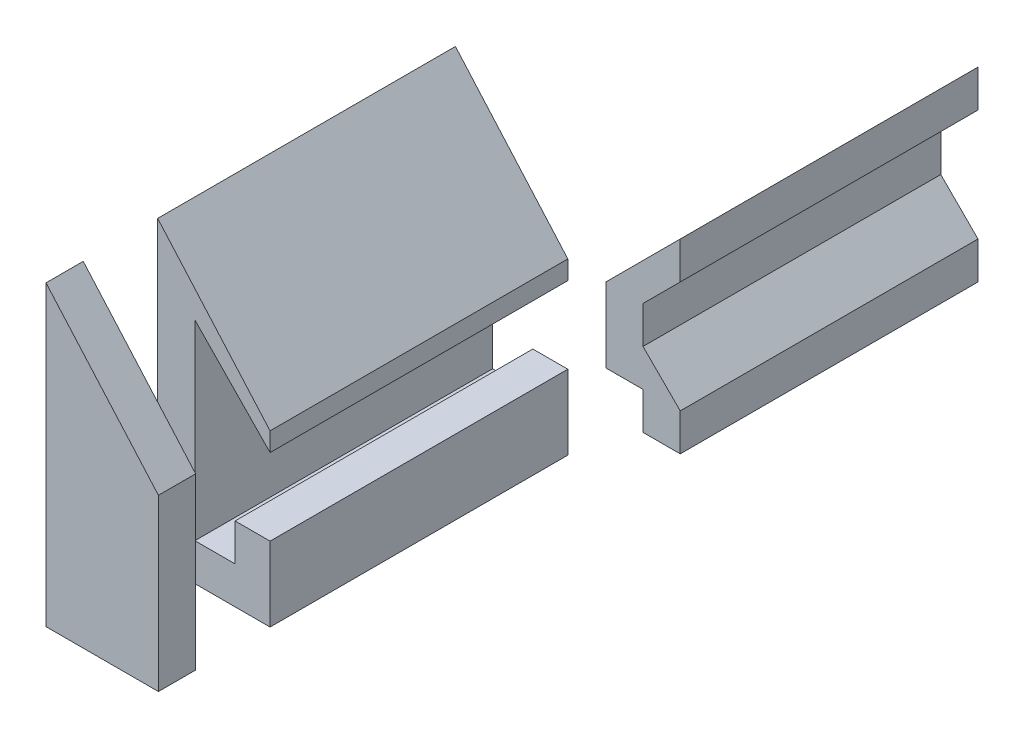
ISO-10303-21;
HEADER;
FILE_DESCRIPTION(('STEP AP214'),'2;1');
FILE_NAME('part.step','',(''),(''),'','','');
FILE_SCHEMA(('AUTOMOTIVE_DESIGN { 1 0 10303 214 1 1 1 1 }'));
ENDSEC;
DATA;
#1=APPLICATION_CONTEXT('core data for automotive mechanical design processes');
#2=APPLICATION_PROTOCOL_DEFINITION('international standard','automotive_design',2000,#1);
#3=PRODUCT_CONTEXT('',#1,'mechanical');
#4=PRODUCT('Part','Part','',(#3));
#5=PRODUCT_RELATED_PRODUCT_CATEGORY('part','',(#4));
#6=PRODUCT_DEFINITION_FORMATION('','',#4);
#7=PRODUCT_DEFINITION_CONTEXT('part definition',#1,'design');
#8=PRODUCT_DEFINITION('design','',#6,#7);
#9=PRODUCT_DEFINITION_SHAPE('','',#8);
#10=(LENGTH_UNIT() NAMED_UNIT(*) SI_UNIT(.MILLI.,.METRE.));
#11=(NAMED_UNIT(*) PLANE_ANGLE_UNIT() SI_UNIT($,.RADIAN.));
#12=(NAMED_UNIT(*) SI_UNIT($,.STERADIAN.) SOLID_ANGLE_UNIT());
#13=UNCERTAINTY_MEASURE_WITH_UNIT(LENGTH_MEASURE(1.E-05),#10,'distance_accuracy_value','');
#14=(GEOMETRIC_REPRESENTATION_CONTEXT(3) GLOBAL_UNCERTAINTY_ASSIGNED_CONTEXT((#13)) GLOBAL_UNIT_ASSIGNED_CONTEXT((#10,
#11,#12)) REPRESENTATION_CONTEXT('',''));
#15=CARTESIAN_POINT('',(0.,0.,0.));
#16=DIRECTION('',(0.,0.,1.));
#17=DIRECTION('',(1.,0.,0.));
#18=AXIS2_PLACEMENT_3D('',#15,#16,#17);
#19=CARTESIAN_POINT('',(0.,-2.5,-50.));
#20=DIRECTION('',(-0.707106781186547,-0.707106781186548,0.));
#21=DIRECTION('',(0.707106781186548,-0.707106781186547,0.));
#22=AXIS2_PLACEMENT_3D('',#19,#20,#21);
#23=PLANE('',#22);
#24=DIRECTION('',(0.707106781186548,-0.707106781186547,0.));
#25=VECTOR('',#24,1.);
#26=CARTESIAN_POINT('',(0.,-2.5,-10.));
#27=LINE('',#26,#25);
#28=CARTESIAN_POINT('',(0.,-2.5,-10.));
#29=VERTEX_POINT('',#28);
#30=CARTESIAN_POINT('',(5.,-7.49999999999999,-10.));
#31=VERTEX_POINT('',#30);
#32=EDGE_CURVE('E155',#29,#31,#27,.T.);
#33=ORIENTED_EDGE('',*,*,#32,.T.);
#34=DIRECTION('',(0.,0.,1.));
#35=VECTOR('',#34,1.);
#36=CARTESIAN_POINT('',(5.,-7.49999999999999,-50.));
#37=LINE('',#36,#35);
#38=CARTESIAN_POINT('',(5.,-7.49999999999999,-50.));
#39=VERTEX_POINT('',#38);
#40=EDGE_CURVE('E12',#39,#31,#37,.T.);
#41=ORIENTED_EDGE('',*,*,#40,.F.);
#42=DIRECTION('',(0.707106781186548,-0.707106781186547,0.));
#43=VECTOR('',#42,1.);
#44=CARTESIAN_POINT('',(0.,-2.5,-50.));
#45=LINE('',#44,#43);
#46=CARTESIAN_POINT('',(0.,-2.5,-50.));
#47=VERTEX_POINT('',#46);
#48=EDGE_CURVE('E175',#47,#39,#45,.T.);
#49=ORIENTED_EDGE('',*,*,#48,.F.);
#50=DIRECTION('',(0.,0.,1.));
#51=VECTOR('',#50,1.);
#52=CARTESIAN_POINT('',(0.,-2.5,-50.));
#53=LINE('',#52,#51);
#54=EDGE_CURVE('E151',#47,#29,#53,.T.);
#55=ORIENTED_EDGE('',*,*,#54,.T.);
#56=EDGE_LOOP('',(#33,#41,#49,#55));
#57=FACE_BOUND('',#56,.T.);
#58=ADVANCED_FACE('F46',(#57),#23,.F.);
#59=CARTESIAN_POINT('',(5.,-7.49999999999999,-50.));
#60=DIRECTION('',(-1.,0.,0.));
#61=DIRECTION('',(0.,-1.,0.));
#62=AXIS2_PLACEMENT_3D('',#59,#60,#61);
#63=PLANE('',#62);
#64=DIRECTION('',(0.,-1.,0.));
#65=VECTOR('',#64,1.);
#66=CARTESIAN_POINT('',(5.,-7.49999999999999,-10.));
#67=LINE('',#66,#65);
#68=CARTESIAN_POINT('',(5.,-12.5,-10.));
#69=VERTEX_POINT('',#68);
#70=EDGE_CURVE('E158',#31,#69,#67,.T.);
#71=ORIENTED_EDGE('',*,*,#70,.T.);
#72=DIRECTION('',(0.,0.,1.));
#73=VECTOR('',#72,1.);
#74=CARTESIAN_POINT('',(5.,-12.5,-50.));
#75=LINE('',#74,#73);
#76=CARTESIAN_POINT('',(5.,-12.5,-50.));
#77=VERTEX_POINT('',#76);
#78=EDGE_CURVE('E54',#77,#69,#75,.T.);
#79=ORIENTED_EDGE('',*,*,#78,.F.);
#80=DIRECTION('',(0.,-1.,0.));
#81=VECTOR('',#80,1.);
#82=CARTESIAN_POINT('',(5.,-7.49999999999999,-50.));
#83=LINE('',#82,#81);
#84=EDGE_CURVE('E111',#39,#77,#83,.T.);
#85=ORIENTED_EDGE('',*,*,#84,.F.);
#86=ORIENTED_EDGE('',*,*,#40,.T.);
#87=EDGE_LOOP('',(#71,#79,#85,#86));
#88=FACE_BOUND('',#87,.T.);
#89=ADVANCED_FACE('F221',(#88),#63,.F.);
#90=CARTESIAN_POINT('',(5.,-12.5,-50.));
#91=DIRECTION('',(0.,1.,0.));
#92=DIRECTION('',(0.,0.,1.));
#93=AXIS2_PLACEMENT_3D('',#90,#91,#92);
#94=PLANE('',#93);
#95=DIRECTION('',(-1.,0.,0.));
#96=VECTOR('',#95,1.);
#97=CARTESIAN_POINT('',(5.,-12.5,-10.));
#98=LINE('',#97,#96);
#99=CARTESIAN_POINT('',(0.,-12.5,-10.));
#100=VERTEX_POINT('',#99);
#101=EDGE_CURVE('E160',#69,#100,#98,.T.);
#102=ORIENTED_EDGE('',*,*,#101,.T.);
#103=DIRECTION('',(0.,0.,1.));
#104=VECTOR('',#103,1.);
#105=CARTESIAN_POINT('',(0.,-12.5,-50.));
#106=LINE('',#105,#104);
#107=CARTESIAN_POINT('',(0.,-12.5,-50.));
#108=VERTEX_POINT('',#107);
#109=EDGE_CURVE('E186',#108,#100,#106,.T.);
#110=ORIENTED_EDGE('',*,*,#109,.F.);
#111=DIRECTION('',(-1.,0.,0.));
#112=VECTOR('',#111,1.);
#113=CARTESIAN_POINT('',(5.,-12.5,-50.));
#114=LINE('',#113,#112);
#115=EDGE_CURVE('E194',#77,#108,#114,.T.);
#116=ORIENTED_EDGE('',*,*,#115,.F.);
#117=ORIENTED_EDGE('',*,*,#78,.T.);
#118=EDGE_LOOP('',(#102,#110,#116,#117));
#119=FACE_BOUND('',#118,.T.);
#120=ADVANCED_FACE('F192',(#119),#94,.F.);
#121=CARTESIAN_POINT('',(0.,-12.5,-50.));
#122=DIRECTION('',(1.,0.,0.));
#123=DIRECTION('',(0.,0.,-1.));
#124=AXIS2_PLACEMENT_3D('',#121,#122,#123);
#125=PLANE('',#124);
#126=DIRECTION('',(0.,1.,0.));
#127=VECTOR('',#126,1.);
#128=CARTESIAN_POINT('',(0.,-12.5,-10.));
#129=LINE('',#128,#127);
#130=CARTESIAN_POINT('',(0.,-7.5,-10.));
#131=VERTEX_POINT('',#130);
#132=EDGE_CURVE('E162',#100,#131,#129,.T.);
#133=ORIENTED_EDGE('',*,*,#132,.T.);
#134=DIRECTION('',(0.,0.,1.));
#135=VECTOR('',#134,1.);
#136=CARTESIAN_POINT('',(0.,-7.5,-50.));
#137=LINE('',#136,#135);
#138=CARTESIAN_POINT('',(0.,-7.5,-50.));
#139=VERTEX_POINT('',#138);
#140=EDGE_CURVE('E183',#139,#131,#137,.T.);
#141=ORIENTED_EDGE('',*,*,#140,.F.);
#142=DIRECTION('',(0.,1.,0.));
#143=VECTOR('',#142,1.);
#144=CARTESIAN_POINT('',(0.,-12.5,-50.));
#145=LINE('',#144,#143);
#146=EDGE_CURVE('E211',#108,#139,#145,.T.);
#147=ORIENTED_EDGE('',*,*,#146,.F.);
#148=ORIENTED_EDGE('',*,*,#109,.T.);
#149=EDGE_LOOP('',(#133,#141,#147,#148));
#150=FACE_BOUND('',#149,.T.);
#151=ADVANCED_FACE('F202',(#150),#125,.F.);
#152=CARTESIAN_POINT('',(0.,-7.5,-50.));
#153=DIRECTION('',(0.,1.,0.));
#154=DIRECTION('',(0.,0.,1.));
#155=AXIS2_PLACEMENT_3D('',#152,#153,#154);
#156=PLANE('',#155);
#157=DIRECTION('',(-1.,0.,0.));
#158=VECTOR('',#157,1.);
#159=CARTESIAN_POINT('',(0.,-7.5,-10.));
#160=LINE('',#159,#158);
#161=CARTESIAN_POINT('',(-5.,-7.5,-10.));
#162=VERTEX_POINT('',#161);
#163=EDGE_CURVE('E164',#131,#162,#160,.T.);
#164=ORIENTED_EDGE('',*,*,#163,.T.);
#165=DIRECTION('',(0.,0.,1.));
#166=VECTOR('',#165,1.);
#167=CARTESIAN_POINT('',(-5.,-7.5,-50.));
#168=LINE('',#167,#166);
#169=CARTESIAN_POINT('',(-5.,-7.5,-50.));
#170=VERTEX_POINT('',#169);
#171=EDGE_CURVE('E181',#170,#162,#168,.T.);
#172=ORIENTED_EDGE('',*,*,#171,.F.);
#173=DIRECTION('',(-1.,0.,0.));
#174=VECTOR('',#173,1.);
#175=CARTESIAN_POINT('',(0.,-7.5,-50.));
#176=LINE('',#175,#174);
#177=EDGE_CURVE('E208',#139,#170,#176,.T.);
#178=ORIENTED_EDGE('',*,*,#177,.F.);
#179=ORIENTED_EDGE('',*,*,#140,.T.);
#180=EDGE_LOOP('',(#164,#172,#178,#179));
#181=FACE_BOUND('',#180,.T.);
#182=ADVANCED_FACE('F206',(#181),#156,.F.);
#183=CARTESIAN_POINT('',(-5.,2.5,-50.));
#184=DIRECTION('',(-1.,0.,0.));
#185=DIRECTION('',(0.,0.,1.));
#186=AXIS2_PLACEMENT_3D('',#183,#184,#185);
#187=PLANE('',#186);
#188=DIRECTION('',(0.,-1.,0.));
#189=VECTOR('',#188,1.);
#190=CARTESIAN_POINT('',(-5.,2.5,-10.));
#191=LINE('',#190,#189);
#192=CARTESIAN_POINT('',(-5.,2.5,-10.));
#193=VERTEX_POINT('',#192);
#194=EDGE_CURVE('E167',#193,#162,#191,.T.);
#195=ORIENTED_EDGE('',*,*,#194,.F.);
#196=DIRECTION('',(0.,0.,1.));
#197=VECTOR('',#196,1.);
#198=CARTESIAN_POINT('',(-5.,2.5,-50.));
#199=LINE('',#198,#197);
#200=CARTESIAN_POINT('',(-5.,2.5,-50.));
#201=VERTEX_POINT('',#200);
#202=EDGE_CURVE('E179',#201,#193,#199,.T.);
#203=ORIENTED_EDGE('',*,*,#202,.F.);
#204=DIRECTION('',(0.,-1.,0.));
#205=VECTOR('',#204,1.);
#206=CARTESIAN_POINT('',(-5.,2.5,-50.));
#207=LINE('',#206,#205);
#208=EDGE_CURVE('E210',#201,#170,#207,.T.);
#209=ORIENTED_EDGE('',*,*,#208,.T.);
#210=ORIENTED_EDGE('',*,*,#171,.T.);
#211=EDGE_LOOP('',(#195,#203,#209,#210));
#212=FACE_BOUND('',#211,.T.);
#213=ADVANCED_FACE('F233',(#212),#187,.T.);
#214=CARTESIAN_POINT('',(-5.,2.5,-50.));
#215=DIRECTION('',(0.707106781186547,-0.707106781186548,0.));
#216=DIRECTION('',(0.707106781186548,0.707106781186547,0.));
#217=AXIS2_PLACEMENT_3D('',#214,#215,#216);
#218=PLANE('',#217);
#219=DIRECTION('',(0.707106781186548,0.707106781186547,0.));
#220=VECTOR('',#219,1.);
#221=CARTESIAN_POINT('',(-5.,2.5,-10.));
#222=LINE('',#221,#220);
#223=CARTESIAN_POINT('',(5.,12.5,-10.));
#224=VERTEX_POINT('',#223);
#225=EDGE_CURVE('E170',#193,#224,#222,.T.);
#226=ORIENTED_EDGE('',*,*,#225,.T.);
#227=DIRECTION('',(0.,0.,1.));
#228=VECTOR('',#227,1.);
#229=CARTESIAN_POINT('',(5.,12.5,-50.));
#230=LINE('',#229,#228);
#231=CARTESIAN_POINT('',(5.,12.5,-50.));
#232=VERTEX_POINT('',#231);
#233=EDGE_CURVE('E146',#232,#224,#230,.T.);
#234=ORIENTED_EDGE('',*,*,#233,.F.);
#235=DIRECTION('',(0.707106781186548,0.707106781186547,0.));
#236=VECTOR('',#235,1.);
#237=CARTESIAN_POINT('',(-5.,2.5,-50.));
#238=LINE('',#237,#236);
#239=EDGE_CURVE('E137',#201,#232,#238,.T.);
#240=ORIENTED_EDGE('',*,*,#239,.F.);
#241=ORIENTED_EDGE('',*,*,#202,.T.);
#242=EDGE_LOOP('',(#226,#234,#240,#241));
#243=FACE_BOUND('',#242,.T.);
#244=ADVANCED_FACE('F236',(#243),#218,.F.);
#245=CARTESIAN_POINT('',(5.,12.5,-50.));
#246=DIRECTION('',(-1.,0.,0.));
#247=DIRECTION('',(0.,0.,1.));
#248=AXIS2_PLACEMENT_3D('',#245,#246,#247);
#249=PLANE('',#248);
#250=DIRECTION('',(0.,-1.,0.));
#251=VECTOR('',#250,1.);
#252=CARTESIAN_POINT('',(5.,12.5,-10.));
#253=LINE('',#252,#251);
#254=CARTESIAN_POINT('',(5.,7.5,-10.));
#255=VERTEX_POINT('',#254);
#256=EDGE_CURVE('E145',#224,#255,#253,.T.);
#257=ORIENTED_EDGE('',*,*,#256,.T.);
#258=DIRECTION('',(0.,0.,1.));
#259=VECTOR('',#258,1.);
#260=CARTESIAN_POINT('',(5.,7.5,-50.));
#261=LINE('',#260,#259);
#262=CARTESIAN_POINT('',(5.,7.5,-50.));
#263=VERTEX_POINT('',#262);
#264=EDGE_CURVE('E142',#263,#255,#261,.T.);
#265=ORIENTED_EDGE('',*,*,#264,.F.);
#266=DIRECTION('',(0.,-1.,0.));
#267=VECTOR('',#266,1.);
#268=CARTESIAN_POINT('',(5.,12.5,-50.));
#269=LINE('',#268,#267);
#270=EDGE_CURVE('E130',#232,#263,#269,.T.);
#271=ORIENTED_EDGE('',*,*,#270,.F.);
#272=ORIENTED_EDGE('',*,*,#233,.T.);
#273=EDGE_LOOP('',(#257,#265,#271,#272));
#274=FACE_BOUND('',#273,.T.);
#275=ADVANCED_FACE('F143',(#274),#249,.F.);
#276=CARTESIAN_POINT('',(5.,7.5,-50.));
#277=DIRECTION('',(-0.707106781186547,0.707106781186548,0.));
#278=DIRECTION('',(-0.707106781186548,-0.707106781186547,0.));
#279=AXIS2_PLACEMENT_3D('',#276,#277,#278);
#280=PLANE('',#279);
#281=DIRECTION('',(-0.707106781186548,-0.707106781186547,0.));
#282=VECTOR('',#281,1.);
#283=CARTESIAN_POINT('',(5.,7.5,-10.));
#284=LINE('',#283,#282);
#285=CARTESIAN_POINT('',(0.,2.5,-10.));
#286=VERTEX_POINT('',#285);
#287=EDGE_CURVE('E97',#255,#286,#284,.T.);
#288=ORIENTED_EDGE('',*,*,#287,.T.);
#289=DIRECTION('',(0.,0.,1.));
#290=VECTOR('',#289,1.);
#291=CARTESIAN_POINT('',(0.,2.5,-50.));
#292=LINE('',#291,#290);
#293=CARTESIAN_POINT('',(0.,2.5,-50.));
#294=VERTEX_POINT('',#293);
#295=EDGE_CURVE('E147',#294,#286,#292,.T.);
#296=ORIENTED_EDGE('',*,*,#295,.F.);
#297=DIRECTION('',(-0.707106781186548,-0.707106781186547,0.));
#298=VECTOR('',#297,1.);
#299=CARTESIAN_POINT('',(5.,7.5,-50.));
#300=LINE('',#299,#298);
#301=EDGE_CURVE('E134',#263,#294,#300,.T.);
#302=ORIENTED_EDGE('',*,*,#301,.F.);
#303=ORIENTED_EDGE('',*,*,#264,.T.);
#304=EDGE_LOOP('',(#288,#296,#302,#303));
#305=FACE_BOUND('',#304,.T.);
#306=ADVANCED_FACE('F149',(#305),#280,.F.);
#307=CARTESIAN_POINT('',(0.,2.5,-50.));
#308=DIRECTION('',(-1.,0.,0.));
#309=DIRECTION('',(0.,0.,1.));
#310=AXIS2_PLACEMENT_3D('',#307,#308,#309);
#311=PLANE('',#310);
#312=DIRECTION('',(0.,-1.,0.));
#313=VECTOR('',#312,1.);
#314=CARTESIAN_POINT('',(0.,2.5,-10.));
#315=LINE('',#314,#313);
#316=EDGE_CURVE('E103',#286,#29,#315,.T.);
#317=ORIENTED_EDGE('',*,*,#316,.T.);
#318=ORIENTED_EDGE('',*,*,#54,.F.);
#319=DIRECTION('',(0.,-1.,0.));
#320=VECTOR('',#319,1.);
#321=CARTESIAN_POINT('',(0.,2.5,-50.));
#322=LINE('',#321,#320);
#323=EDGE_CURVE('E62',#294,#47,#322,.T.);
#324=ORIENTED_EDGE('',*,*,#323,.F.);
#325=ORIENTED_EDGE('',*,*,#295,.T.);
#326=EDGE_LOOP('',(#317,#318,#324,#325));
#327=FACE_BOUND('',#326,.T.);
#328=ADVANCED_FACE('F245',(#327),#311,.F.);
#329=CARTESIAN_POINT('',(0.,0.,-50.));
#330=DIRECTION('',(0.,0.,1.));
#331=DIRECTION('',(1.,0.,0.));
#332=AXIS2_PLACEMENT_3D('',#329,#330,#331);
#333=PLANE('',#332);
#334=ORIENTED_EDGE('',*,*,#48,.T.);
#335=ORIENTED_EDGE('',*,*,#84,.T.);
#336=ORIENTED_EDGE('',*,*,#115,.T.);
#337=ORIENTED_EDGE('',*,*,#146,.T.);
#338=ORIENTED_EDGE('',*,*,#177,.T.);
#339=ORIENTED_EDGE('',*,*,#208,.F.);
#340=ORIENTED_EDGE('',*,*,#239,.T.);
#341=ORIENTED_EDGE('',*,*,#270,.T.);
#342=ORIENTED_EDGE('',*,*,#301,.T.);
#343=ORIENTED_EDGE('',*,*,#323,.T.);
#344=EDGE_LOOP('',(#334,#335,#336,#337,#338,#339,#340,#341,#342,#343));
#345=FACE_BOUND('',#344,.T.);
#346=ADVANCED_FACE('F132',(#345),#333,.F.);
#347=CARTESIAN_POINT('',(0.,0.,-10.));
#348=DIRECTION('',(0.,0.,1.));
#349=DIRECTION('',(1.,0.,0.));
#350=AXIS2_PLACEMENT_3D('',#347,#348,#349);
#351=PLANE('',#350);
#352=ORIENTED_EDGE('',*,*,#32,.F.);
#353=ORIENTED_EDGE('',*,*,#316,.F.);
#354=ORIENTED_EDGE('',*,*,#287,.F.);
#355=ORIENTED_EDGE('',*,*,#256,.F.);
#356=ORIENTED_EDGE('',*,*,#225,.F.);
#357=ORIENTED_EDGE('',*,*,#194,.T.);
#358=ORIENTED_EDGE('',*,*,#163,.F.);
#359=ORIENTED_EDGE('',*,*,#132,.F.);
#360=ORIENTED_EDGE('',*,*,#101,.F.);
#361=ORIENTED_EDGE('',*,*,#70,.F.);
#362=EDGE_LOOP('',(#352,#353,#354,#355,#356,#357,#358,#359,#360,#361));
#363=FACE_BOUND('',#362,.T.);
#364=ADVANCED_FACE('F198',(#363),#351,.T.);
#365=CLOSED_SHELL('',(#58,#89,#120,#151,#182,#213,#244,#275,#306,#328,#346,#364));
#366=MANIFOLD_SOLID_BREP('B2',#365);
#367=CARTESIAN_POINT('',(-0.1,12.6319336218707,55.));
#368=DIRECTION('',(-0.7508848175328,-0.660433184204681,0.));
#369=DIRECTION('',(0.660433184204681,-0.7508848175328,0.));
#370=AXIS2_PLACEMENT_3D('',#367,#368,#369);
#371=PLANE('',#370);
#372=DIRECTION('',(-0.660433184204681,0.7508848175328,0.));
#373=VECTOR('',#372,1.);
#374=CARTESIAN_POINT('',(-0.1,12.6319336218707,50.));
#375=LINE('',#374,#373);
#376=CARTESIAN_POINT('',(-0.1,12.6319336218707,50.));
#377=VERTEX_POINT('',#376);
#378=CARTESIAN_POINT('',(-15.2,29.8,50.));
#379=VERTEX_POINT('',#378);
#380=EDGE_CURVE('E389',#377,#379,#375,.T.);
#381=ORIENTED_EDGE('',*,*,#380,.T.);
#382=DIRECTION('',(0.,0.,-1.));
#383=VECTOR('',#382,1.);
#384=CARTESIAN_POINT('',(-15.2,29.8,55.));
#385=LINE('',#384,#383);
#386=CARTESIAN_POINT('',(-15.2,29.8,55.));
#387=VERTEX_POINT('',#386);
#388=EDGE_CURVE('E343',#387,#379,#385,.T.);
#389=ORIENTED_EDGE('',*,*,#388,.F.);
#390=DIRECTION('',(-0.660433184204681,0.7508848175328,0.));
#391=VECTOR('',#390,1.);
#392=CARTESIAN_POINT('',(-0.1,12.6319336218707,55.));
#393=LINE('',#392,#391);
#394=CARTESIAN_POINT('',(-0.1,12.6319336218707,55.));
#395=VERTEX_POINT('',#394);
#396=EDGE_CURVE('E383',#395,#387,#393,.T.);
#397=ORIENTED_EDGE('',*,*,#396,.F.);
#398=DIRECTION('',(0.,0.,-1.));
#399=VECTOR('',#398,1.);
#400=CARTESIAN_POINT('',(-0.1,12.6319336218707,55.));
#401=LINE('',#400,#399);
#402=EDGE_CURVE('E44',#395,#377,#401,.T.);
#403=ORIENTED_EDGE('',*,*,#402,.T.);
#404=EDGE_LOOP('',(#381,#389,#397,#403));
#405=FACE_BOUND('',#404,.T.);
#406=ADVANCED_FACE('F335',(#405),#371,.F.);
#407=CARTESIAN_POINT('',(-15.2,29.8,55.));
#408=DIRECTION('',(1.,0.,0.));
#409=DIRECTION('',(0.,1.,0.));
#410=AXIS2_PLACEMENT_3D('',#407,#408,#409);
#411=PLANE('',#410);
#412=DIRECTION('',(0.,-1.,0.));
#413=VECTOR('',#412,1.);
#414=CARTESIAN_POINT('',(-15.2,29.8,50.));
#415=LINE('',#414,#413);
#416=CARTESIAN_POINT('',(-15.2,-10.2,50.));
#417=VERTEX_POINT('',#416);
#418=EDGE_CURVE('E369',#379,#417,#415,.T.);
#419=ORIENTED_EDGE('',*,*,#418,.T.);
#420=DIRECTION('',(0.,0.,-1.));
#421=VECTOR('',#420,1.);
#422=CARTESIAN_POINT('',(-15.2,-10.2,55.));
#423=LINE('',#422,#421);
#424=CARTESIAN_POINT('',(-15.2,-10.2,55.));
#425=VERTEX_POINT('',#424);
#426=EDGE_CURVE('E390',#425,#417,#423,.T.);
#427=ORIENTED_EDGE('',*,*,#426,.F.);
#428=DIRECTION('',(0.,-1.,0.));
#429=VECTOR('',#428,1.);
#430=CARTESIAN_POINT('',(-15.2,29.8,55.));
#431=LINE('',#430,#429);
#432=EDGE_CURVE('E387',#387,#425,#431,.T.);
#433=ORIENTED_EDGE('',*,*,#432,.F.);
#434=ORIENTED_EDGE('',*,*,#388,.T.);
#435=EDGE_LOOP('',(#419,#427,#433,#434));
#436=FACE_BOUND('',#435,.T.);
#437=ADVANCED_FACE('F391',(#436),#411,.F.);
#438=CARTESIAN_POINT('',(-15.2,-10.2,55.));
#439=DIRECTION('',(0.,1.,0.));
#440=DIRECTION('',(-1.,0.,0.));
#441=AXIS2_PLACEMENT_3D('',#438,#439,#440);
#442=PLANE('',#441);
#443=DIRECTION('',(1.,0.,0.));
#444=VECTOR('',#443,1.);
#445=CARTESIAN_POINT('',(-15.2,-10.2,50.));
#446=LINE('',#445,#444);
#447=CARTESIAN_POINT('',(-0.0999999999999988,-10.2,50.));
#448=VERTEX_POINT('',#447);
#449=EDGE_CURVE('E401',#417,#448,#446,.T.);
#450=ORIENTED_EDGE('',*,*,#449,.T.);
#451=DIRECTION('',(0.,0.,-1.));
#452=VECTOR('',#451,1.);
#453=CARTESIAN_POINT('',(-0.0999999999999988,-10.2,55.));
#454=LINE('',#453,#452);
#455=CARTESIAN_POINT('',(-0.0999999999999988,-10.2,55.));
#456=VERTEX_POINT('',#455);
#457=EDGE_CURVE('E395',#456,#448,#454,.T.);
#458=ORIENTED_EDGE('',*,*,#457,.F.);
#459=DIRECTION('',(1.,0.,0.));
#460=VECTOR('',#459,1.);
#461=CARTESIAN_POINT('',(-15.2,-10.2,55.));
#462=LINE('',#461,#460);
#463=EDGE_CURVE('E393',#425,#456,#462,.T.);
#464=ORIENTED_EDGE('',*,*,#463,.F.);
#465=ORIENTED_EDGE('',*,*,#426,.T.);
#466=EDGE_LOOP('',(#450,#458,#464,#465));
#467=FACE_BOUND('',#466,.T.);
#468=ADVANCED_FACE('F406',(#467),#442,.F.);
#469=CARTESIAN_POINT('',(-0.1,-0.2,55.));
#470=DIRECTION('',(-1.,0.,0.));
#471=DIRECTION('',(0.,-1.,0.));
#472=AXIS2_PLACEMENT_3D('',#469,#470,#471);
#473=PLANE('',#472);
#474=DIRECTION('',(0.,1.,0.));
#475=VECTOR('',#474,1.);
#476=CARTESIAN_POINT('',(-0.1,-0.2,50.));
#477=LINE('',#476,#475);
#478=EDGE_CURVE('E376',#448,#377,#477,.T.);
#479=ORIENTED_EDGE('',*,*,#478,.T.);
#480=ORIENTED_EDGE('',*,*,#402,.F.);
#481=DIRECTION('',(0.,1.,0.));
#482=VECTOR('',#481,1.);
#483=CARTESIAN_POINT('',(-0.1,10.1027729677694,55.));
#484=LINE('',#483,#482);
#485=EDGE_CURVE('E351',#456,#395,#484,.T.);
#486=ORIENTED_EDGE('',*,*,#485,.F.);
#487=ORIENTED_EDGE('',*,*,#457,.T.);
#488=EDGE_LOOP('',(#479,#480,#486,#487));
#489=FACE_BOUND('',#488,.T.);
#490=ADVANCED_FACE('F409',(#489),#473,.F.);
#491=CARTESIAN_POINT('',(0.,0.,55.));
#492=DIRECTION('',(0.,0.,-1.));
#493=DIRECTION('',(-1.,0.,0.));
#494=AXIS2_PLACEMENT_3D('',#491,#492,#493);
#495=PLANE('',#494);
#496=ORIENTED_EDGE('',*,*,#485,.T.);
#497=ORIENTED_EDGE('',*,*,#396,.T.);
#498=ORIENTED_EDGE('',*,*,#432,.T.);
#499=ORIENTED_EDGE('',*,*,#463,.T.);
#500=EDGE_LOOP('',(#496,#497,#498,#499));
#501=FACE_BOUND('',#500,.T.);
#502=ADVANCED_FACE('F385',(#501),#495,.F.);
#503=CARTESIAN_POINT('',(0.,0.,50.));
#504=DIRECTION('',(0.,0.,-1.));
#505=DIRECTION('',(-1.,0.,0.));
#506=AXIS2_PLACEMENT_3D('',#503,#504,#505);
#507=PLANE('',#506);
#508=ORIENTED_EDGE('',*,*,#380,.F.);
#509=ORIENTED_EDGE('',*,*,#478,.F.);
#510=ORIENTED_EDGE('',*,*,#449,.F.);
#511=ORIENTED_EDGE('',*,*,#418,.F.);
#512=EDGE_LOOP('',(#508,#509,#510,#511));
#513=FACE_BOUND('',#512,.T.);
#514=ADVANCED_FACE('F408',(#513),#507,.T.);
#515=CLOSED_SHELL('',(#406,#437,#468,#490,#502,#514));
#516=MANIFOLD_SOLID_BREP('B6',#515);
#517=CARTESIAN_POINT('',(-0.1,10.1027729677694,40.));
#518=DIRECTION('',(-1.,0.,0.));
#519=DIRECTION('',(0.,0.,1.));
#520=AXIS2_PLACEMENT_3D('',#517,#518,#519);
#521=PLANE('',#520);
#522=DIRECTION('',(0.,1.,0.));
#523=VECTOR('',#522,1.);
#524=CARTESIAN_POINT('',(-0.1,10.1027729677694,0.));
#525=LINE('',#524,#523);
#526=CARTESIAN_POINT('',(-0.1,10.1027729677694,0.));
#527=VERTEX_POINT('',#526);
#528=CARTESIAN_POINT('',(-0.1,12.6319336218707,0.));
#529=VERTEX_POINT('',#528);
#530=EDGE_CURVE('E573',#527,#529,#525,.T.);
#531=ORIENTED_EDGE('',*,*,#530,.T.);
#532=DIRECTION('',(0.,0.,-1.));
#533=VECTOR('',#532,1.);
#534=CARTESIAN_POINT('',(-0.1,12.6319336218707,40.));
#535=LINE('',#534,#533);
#536=CARTESIAN_POINT('',(-0.1,12.6319336218707,40.));
#537=VERTEX_POINT('',#536);
#538=EDGE_CURVE('E333',#537,#529,#535,.T.);
#539=ORIENTED_EDGE('',*,*,#538,.F.);
#540=DIRECTION('',(0.,1.,0.));
#541=VECTOR('',#540,1.);
#542=CARTESIAN_POINT('',(-0.1,10.1027729677694,40.));
#543=LINE('',#542,#541);
#544=CARTESIAN_POINT('',(-0.1,10.1027729677694,40.));
#545=VERTEX_POINT('',#544);
#546=EDGE_CURVE('E591',#545,#537,#543,.T.);
#547=ORIENTED_EDGE('',*,*,#546,.F.);
#548=DIRECTION('',(0.,0.,-1.));
#549=VECTOR('',#548,1.);
#550=CARTESIAN_POINT('',(-0.1,10.1027729677694,40.));
#551=LINE('',#550,#549);
#552=EDGE_CURVE('E569',#545,#527,#551,.T.);
#553=ORIENTED_EDGE('',*,*,#552,.T.);
#554=EDGE_LOOP('',(#531,#539,#547,#553));
#555=FACE_BOUND('',#554,.T.);
#556=ADVANCED_FACE('F465',(#555),#521,.F.);
#557=CARTESIAN_POINT('',(-0.1,12.6319336218707,40.));
#558=DIRECTION('',(-0.7508848175328,-0.660433184204681,0.));
#559=DIRECTION('',(0.660433184204681,-0.7508848175328,0.));
#560=AXIS2_PLACEMENT_3D('',#557,#558,#559);
#561=PLANE('',#560);
#562=DIRECTION('',(-0.660433184204681,0.7508848175328,0.));
#563=VECTOR('',#562,1.);
#564=CARTESIAN_POINT('',(-0.1,12.6319336218707,0.));
#565=LINE('',#564,#563);
#566=CARTESIAN_POINT('',(-15.2,29.8,0.));
#567=VERTEX_POINT('',#566);
#568=EDGE_CURVE('E576',#529,#567,#565,.T.);
#569=ORIENTED_EDGE('',*,*,#568,.T.);
#570=DIRECTION('',(0.,0.,-1.));
#571=VECTOR('',#570,1.);
#572=CARTESIAN_POINT('',(-15.2,29.8,40.));
#573=LINE('',#572,#571);
#574=CARTESIAN_POINT('',(-15.2,29.8,40.));
#575=VERTEX_POINT('',#574);
#576=EDGE_CURVE('E473',#575,#567,#573,.T.);
#577=ORIENTED_EDGE('',*,*,#576,.F.);
#578=DIRECTION('',(-0.660433184204681,0.7508848175328,0.));
#579=VECTOR('',#578,1.);
#580=CARTESIAN_POINT('',(-0.1,12.6319336218707,40.));
#581=LINE('',#580,#579);
#582=EDGE_CURVE('E530',#537,#575,#581,.T.);
#583=ORIENTED_EDGE('',*,*,#582,.F.);
#584=ORIENTED_EDGE('',*,*,#538,.T.);
#585=EDGE_LOOP('',(#569,#577,#583,#584));
#586=FACE_BOUND('',#585,.T.);
#587=ADVANCED_FACE('F640',(#586),#561,.F.);
#588=CARTESIAN_POINT('',(-15.2,29.8,40.));
#589=DIRECTION('',(1.,0.,0.));
#590=DIRECTION('',(0.,1.,0.));
#591=AXIS2_PLACEMENT_3D('',#588,#589,#590);
#592=PLANE('',#591);
#593=DIRECTION('',(0.,-1.,0.));
#594=VECTOR('',#593,1.);
#595=CARTESIAN_POINT('',(-15.2,29.8,0.));
#596=LINE('',#595,#594);
#597=CARTESIAN_POINT('',(-15.2,-10.2,0.));
#598=VERTEX_POINT('',#597);
#599=EDGE_CURVE('E578',#567,#598,#596,.T.);
#600=ORIENTED_EDGE('',*,*,#599,.T.);
#601=DIRECTION('',(0.,0.,-1.));
#602=VECTOR('',#601,1.);
#603=CARTESIAN_POINT('',(-15.2,-10.2,40.));
#604=LINE('',#603,#602);
#605=CARTESIAN_POINT('',(-15.2,-10.2,40.));
#606=VERTEX_POINT('',#605);
#607=EDGE_CURVE('E604',#606,#598,#604,.T.);
#608=ORIENTED_EDGE('',*,*,#607,.F.);
#609=DIRECTION('',(0.,-1.,0.));
#610=VECTOR('',#609,1.);
#611=CARTESIAN_POINT('',(-15.2,29.8,40.));
#612=LINE('',#611,#610);
#613=EDGE_CURVE('E612',#575,#606,#612,.T.);
#614=ORIENTED_EDGE('',*,*,#613,.F.);
#615=ORIENTED_EDGE('',*,*,#576,.T.);
#616=EDGE_LOOP('',(#600,#608,#614,#615));
#617=FACE_BOUND('',#616,.T.);
#618=ADVANCED_FACE('F610',(#617),#592,.F.);
#619=CARTESIAN_POINT('',(-15.2,-10.2,40.));
#620=DIRECTION('',(0.,1.,0.));
#621=DIRECTION('',(-1.,0.,0.));
#622=AXIS2_PLACEMENT_3D('',#619,#620,#621);
#623=PLANE('',#622);
#624=DIRECTION('',(1.,0.,0.));
#625=VECTOR('',#624,1.);
#626=CARTESIAN_POINT('',(-15.2,-10.2,0.));
#627=LINE('',#626,#625);
#628=CARTESIAN_POINT('',(-0.0999999999999988,-10.2,0.));
#629=VERTEX_POINT('',#628);
#630=EDGE_CURVE('E580',#598,#629,#627,.T.);
#631=ORIENTED_EDGE('',*,*,#630,.T.);
#632=DIRECTION('',(0.,0.,-1.));
#633=VECTOR('',#632,1.);
#634=CARTESIAN_POINT('',(-0.0999999999999988,-10.2,40.));
#635=LINE('',#634,#633);
#636=CARTESIAN_POINT('',(-0.0999999999999988,-10.2,40.));
#637=VERTEX_POINT('',#636);
#638=EDGE_CURVE('E601',#637,#629,#635,.T.);
#639=ORIENTED_EDGE('',*,*,#638,.F.);
#640=DIRECTION('',(1.,0.,0.));
#641=VECTOR('',#640,1.);
#642=CARTESIAN_POINT('',(-15.2,-10.2,40.));
#643=LINE('',#642,#641);
#644=EDGE_CURVE('E630',#606,#637,#643,.T.);
#645=ORIENTED_EDGE('',*,*,#644,.F.);
#646=ORIENTED_EDGE('',*,*,#607,.T.);
#647=EDGE_LOOP('',(#631,#639,#645,#646));
#648=FACE_BOUND('',#647,.T.);
#649=ADVANCED_FACE('F621',(#648),#623,.F.);
#650=CARTESIAN_POINT('',(-0.1,-0.2,40.));
#651=DIRECTION('',(-1.,0.,0.));
#652=DIRECTION('',(0.,-1.,0.));
#653=AXIS2_PLACEMENT_3D('',#650,#651,#652);
#654=PLANE('',#653);
#655=DIRECTION('',(0.,1.,0.));
#656=VECTOR('',#655,1.);
#657=CARTESIAN_POINT('',(-0.1,-0.2,0.));
#658=LINE('',#657,#656);
#659=CARTESIAN_POINT('',(-0.1,-0.2,0.));
#660=VERTEX_POINT('',#659);
#661=EDGE_CURVE('E582',#629,#660,#658,.T.);
#662=ORIENTED_EDGE('',*,*,#661,.T.);
#663=DIRECTION('',(0.,0.,-1.));
#664=VECTOR('',#663,1.);
#665=CARTESIAN_POINT('',(-0.1,-0.2,40.));
#666=LINE('',#665,#664);
#667=CARTESIAN_POINT('',(-0.1,-0.2,40.));
#668=VERTEX_POINT('',#667);
#669=EDGE_CURVE('E598',#668,#660,#666,.T.);
#670=ORIENTED_EDGE('',*,*,#669,.F.);
#671=DIRECTION('',(0.,1.,0.));
#672=VECTOR('',#671,1.);
#673=CARTESIAN_POINT('',(-0.1,-0.2,40.));
#674=LINE('',#673,#672);
#675=EDGE_CURVE('E627',#637,#668,#674,.T.);
#676=ORIENTED_EDGE('',*,*,#675,.F.);
#677=ORIENTED_EDGE('',*,*,#638,.T.);
#678=EDGE_LOOP('',(#662,#670,#676,#677));
#679=FACE_BOUND('',#678,.T.);
#680=ADVANCED_FACE('F625',(#679),#654,.F.);
#681=CARTESIAN_POINT('',(-4.8,-0.200000000000001,40.));
#682=DIRECTION('',(0.,-1.,0.));
#683=DIRECTION('',(1.,0.,0.));
#684=AXIS2_PLACEMENT_3D('',#681,#682,#683);
#685=PLANE('',#684);
#686=DIRECTION('',(-1.,0.,0.));
#687=VECTOR('',#686,1.);
#688=CARTESIAN_POINT('',(-4.8,-0.200000000000001,0.));
#689=LINE('',#688,#687);
#690=CARTESIAN_POINT('',(-4.8,-0.200000000000001,0.));
#691=VERTEX_POINT('',#690);
#692=EDGE_CURVE('E584',#660,#691,#689,.T.);
#693=ORIENTED_EDGE('',*,*,#692,.T.);
#694=DIRECTION('',(0.,0.,-1.));
#695=VECTOR('',#694,1.);
#696=CARTESIAN_POINT('',(-4.8,-0.200000000000001,40.));
#697=LINE('',#696,#695);
#698=CARTESIAN_POINT('',(-4.8,-0.200000000000001,40.));
#699=VERTEX_POINT('',#698);
#700=EDGE_CURVE('E595',#699,#691,#697,.T.);
#701=ORIENTED_EDGE('',*,*,#700,.F.);
#702=DIRECTION('',(-1.,0.,0.));
#703=VECTOR('',#702,1.);
#704=CARTESIAN_POINT('',(-4.8,-0.200000000000001,40.));
#705=LINE('',#704,#703);
#706=EDGE_CURVE('E629',#668,#699,#705,.T.);
#707=ORIENTED_EDGE('',*,*,#706,.F.);
#708=ORIENTED_EDGE('',*,*,#669,.T.);
#709=EDGE_LOOP('',(#693,#701,#707,#708));
#710=FACE_BOUND('',#709,.T.);
#711=ADVANCED_FACE('F652',(#710),#685,.F.);
#712=CARTESIAN_POINT('',(-4.8,-5.2,40.));
#713=DIRECTION('',(1.,0.,0.));
#714=DIRECTION('',(0.,0.,-1.));
#715=AXIS2_PLACEMENT_3D('',#712,#713,#714);
#716=PLANE('',#715);
#717=DIRECTION('',(0.,-1.,0.));
#718=VECTOR('',#717,1.);
#719=CARTESIAN_POINT('',(-4.8,-5.2,0.));
#720=LINE('',#719,#718);
#721=CARTESIAN_POINT('',(-4.8,-5.2,0.));
#722=VERTEX_POINT('',#721);
#723=EDGE_CURVE('E586',#691,#722,#720,.T.);
#724=ORIENTED_EDGE('',*,*,#723,.T.);
#725=DIRECTION('',(0.,0.,-1.));
#726=VECTOR('',#725,1.);
#727=CARTESIAN_POINT('',(-4.8,-5.2,40.));
#728=LINE('',#727,#726);
#729=CARTESIAN_POINT('',(-4.8,-5.2,40.));
#730=VERTEX_POINT('',#729);
#731=EDGE_CURVE('E564',#730,#722,#728,.T.);
#732=ORIENTED_EDGE('',*,*,#731,.F.);
#733=DIRECTION('',(0.,-1.,0.));
#734=VECTOR('',#733,1.);
#735=CARTESIAN_POINT('',(-4.8,-5.2,40.));
#736=LINE('',#735,#734);
#737=EDGE_CURVE('E555',#699,#730,#736,.T.);
#738=ORIENTED_EDGE('',*,*,#737,.F.);
#739=ORIENTED_EDGE('',*,*,#700,.T.);
#740=EDGE_LOOP('',(#724,#732,#738,#739));
#741=FACE_BOUND('',#740,.T.);
#742=ADVANCED_FACE('F655',(#741),#716,.F.);
#743=CARTESIAN_POINT('',(-10.2,-5.2,40.));
#744=DIRECTION('',(0.,-1.,0.));
#745=DIRECTION('',(0.,0.,-1.));
#746=AXIS2_PLACEMENT_3D('',#743,#744,#745);
#747=PLANE('',#746);
#748=DIRECTION('',(-1.,0.,0.));
#749=VECTOR('',#748,1.);
#750=CARTESIAN_POINT('',(-10.2,-5.2,0.));
#751=LINE('',#750,#749);
#752=CARTESIAN_POINT('',(-10.2,-5.2,0.));
#753=VERTEX_POINT('',#752);
#754=EDGE_CURVE('E563',#722,#753,#751,.T.);
#755=ORIENTED_EDGE('',*,*,#754,.T.);
#756=DIRECTION('',(0.,0.,-1.));
#757=VECTOR('',#756,1.);
#758=CARTESIAN_POINT('',(-10.2,-5.2,40.));
#759=LINE('',#758,#757);
#760=CARTESIAN_POINT('',(-10.2,-5.2,40.));
#761=VERTEX_POINT('',#760);
#762=EDGE_CURVE('E560',#761,#753,#759,.T.);
#763=ORIENTED_EDGE('',*,*,#762,.F.);
#764=DIRECTION('',(-1.,0.,0.));
#765=VECTOR('',#764,1.);
#766=CARTESIAN_POINT('',(-10.2,-5.2,40.));
#767=LINE('',#766,#765);
#768=EDGE_CURVE('E549',#730,#761,#767,.T.);
#769=ORIENTED_EDGE('',*,*,#768,.F.);
#770=ORIENTED_EDGE('',*,*,#731,.T.);
#771=EDGE_LOOP('',(#755,#763,#769,#770));
#772=FACE_BOUND('',#771,.T.);
#773=ADVANCED_FACE('F561',(#772),#747,.F.);
#774=CARTESIAN_POINT('',(-10.2,20.4828427124746,40.));
#775=DIRECTION('',(-1.,0.,0.));
#776=DIRECTION('',(0.,0.,1.));
#777=AXIS2_PLACEMENT_3D('',#774,#775,#776);
#778=PLANE('',#777);
#779=DIRECTION('',(0.,1.,0.));
#780=VECTOR('',#779,1.);
#781=CARTESIAN_POINT('',(-10.2,20.4828427124746,0.));
#782=LINE('',#781,#780);
#783=CARTESIAN_POINT('',(-10.2,20.4828427124746,0.));
#784=VERTEX_POINT('',#783);
#785=EDGE_CURVE('E516',#753,#784,#782,.T.);
#786=ORIENTED_EDGE('',*,*,#785,.T.);
#787=DIRECTION('',(0.,0.,-1.));
#788=VECTOR('',#787,1.);
#789=CARTESIAN_POINT('',(-10.2,20.4828427124746,40.));
#790=LINE('',#789,#788);
#791=CARTESIAN_POINT('',(-10.2,20.4828427124746,40.));
#792=VERTEX_POINT('',#791);
#793=EDGE_CURVE('E565',#792,#784,#790,.T.);
#794=ORIENTED_EDGE('',*,*,#793,.F.);
#795=DIRECTION('',(0.,1.,0.));
#796=VECTOR('',#795,1.);
#797=CARTESIAN_POINT('',(-10.2,20.4828427124746,40.));
#798=LINE('',#797,#796);
#799=EDGE_CURVE('E553',#761,#792,#798,.T.);
#800=ORIENTED_EDGE('',*,*,#799,.F.);
#801=ORIENTED_EDGE('',*,*,#762,.T.);
#802=EDGE_LOOP('',(#786,#794,#800,#801));
#803=FACE_BOUND('',#802,.T.);
#804=ADVANCED_FACE('F567',(#803),#778,.F.);
#805=CARTESIAN_POINT('',(-0.1,10.1027729677694,40.));
#806=DIRECTION('',(0.716709618309362,0.697371725138644,0.));
#807=DIRECTION('',(-0.697371725138644,0.716709618309362,0.));
#808=AXIS2_PLACEMENT_3D('',#805,#806,#807);
#809=PLANE('',#808);
#810=DIRECTION('',(0.697371725138644,-0.716709618309362,0.));
#811=VECTOR('',#810,1.);
#812=CARTESIAN_POINT('',(-0.1,10.1027729677694,0.));
#813=LINE('',#812,#811);
#814=EDGE_CURVE('E522',#784,#527,#813,.T.);
#815=ORIENTED_EDGE('',*,*,#814,.T.);
#816=ORIENTED_EDGE('',*,*,#552,.F.);
#817=DIRECTION('',(0.697371725138644,-0.716709618309362,0.));
#818=VECTOR('',#817,1.);
#819=CARTESIAN_POINT('',(-0.1,10.1027729677694,40.));
#820=LINE('',#819,#818);
#821=EDGE_CURVE('E481',#792,#545,#820,.T.);
#822=ORIENTED_EDGE('',*,*,#821,.F.);
#823=ORIENTED_EDGE('',*,*,#793,.T.);
#824=EDGE_LOOP('',(#815,#816,#822,#823));
#825=FACE_BOUND('',#824,.T.);
#826=ADVANCED_FACE('F664',(#825),#809,.F.);
#827=CARTESIAN_POINT('',(0.,0.,40.));
#828=DIRECTION('',(0.,0.,-1.));
#829=DIRECTION('',(-1.,0.,0.));
#830=AXIS2_PLACEMENT_3D('',#827,#828,#829);
#831=PLANE('',#830);
#832=ORIENTED_EDGE('',*,*,#546,.T.);
#833=ORIENTED_EDGE('',*,*,#582,.T.);
#834=ORIENTED_EDGE('',*,*,#613,.T.);
#835=ORIENTED_EDGE('',*,*,#644,.T.);
#836=ORIENTED_EDGE('',*,*,#675,.T.);
#837=ORIENTED_EDGE('',*,*,#706,.T.);
#838=ORIENTED_EDGE('',*,*,#737,.T.);
#839=ORIENTED_EDGE('',*,*,#768,.T.);
#840=ORIENTED_EDGE('',*,*,#799,.T.);
#841=ORIENTED_EDGE('',*,*,#821,.T.);
#842=EDGE_LOOP('',(#832,#833,#834,#835,#836,#837,#838,#839,#840,#841));
#843=FACE_BOUND('',#842,.T.);
#844=ADVANCED_FACE('F551',(#843),#831,.F.);
#845=CARTESIAN_POINT('',(0.,0.,0.));
#846=DIRECTION('',(0.,0.,-1.));
#847=DIRECTION('',(-1.,0.,0.));
#848=AXIS2_PLACEMENT_3D('',#845,#846,#847);
#849=PLANE('',#848);
#850=ORIENTED_EDGE('',*,*,#530,.F.);
#851=ORIENTED_EDGE('',*,*,#814,.F.);
#852=ORIENTED_EDGE('',*,*,#785,.F.);
#853=ORIENTED_EDGE('',*,*,#754,.F.);
#854=ORIENTED_EDGE('',*,*,#723,.F.);
#855=ORIENTED_EDGE('',*,*,#692,.F.);
#856=ORIENTED_EDGE('',*,*,#661,.F.);
#857=ORIENTED_EDGE('',*,*,#630,.F.);
#858=ORIENTED_EDGE('',*,*,#599,.F.);
#859=ORIENTED_EDGE('',*,*,#568,.F.);
#860=EDGE_LOOP('',(#850,#851,#852,#853,#854,#855,#856,#857,#858,#859));
#861=FACE_BOUND('',#860,.T.);
#862=ADVANCED_FACE('F616',(#861),#849,.T.);
#863=CLOSED_SHELL('',(#556,#587,#618,#649,#680,#711,#742,#773,#804,#826,#844,#862));
#864=MANIFOLD_SOLID_BREP('B38',#863);
#865=ADVANCED_BREP_SHAPE_REPRESENTATION('',(#18,#366,#516,#864),#14);
#866=SHAPE_DEFINITION_REPRESENTATION(#9,#865);
ENDSEC;
END-ISO-10303-21;
